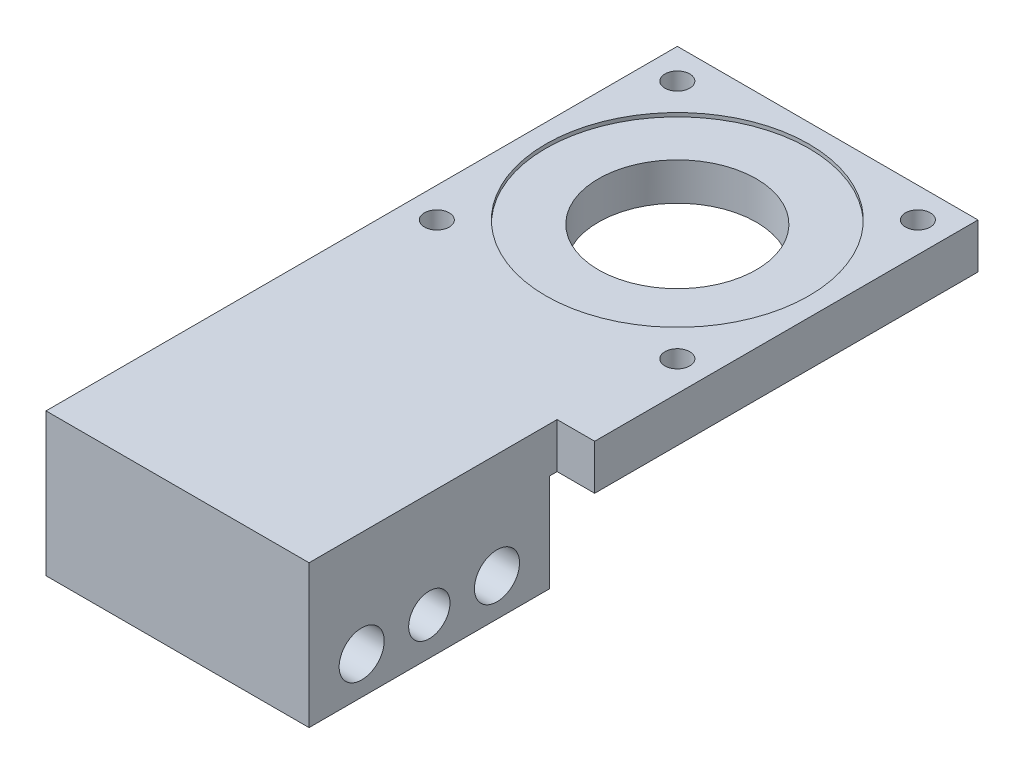
ISO-10303-21;
HEADER;
FILE_DESCRIPTION(('STEP AP214'),'2;1');
FILE_NAME('part.step','',(''),(''),'','','');
FILE_SCHEMA(('AUTOMOTIVE_DESIGN { 1 0 10303 214 1 1 1 1 }'));
ENDSEC;
DATA;
#1=APPLICATION_CONTEXT('core data for automotive mechanical design processes');
#2=APPLICATION_PROTOCOL_DEFINITION('international standard','automotive_design',2000,#1);
#3=PRODUCT_CONTEXT('',#1,'mechanical');
#4=PRODUCT('Part','Part','',(#3));
#5=PRODUCT_RELATED_PRODUCT_CATEGORY('part','',(#4));
#6=PRODUCT_DEFINITION_FORMATION('','',#4);
#7=PRODUCT_DEFINITION_CONTEXT('part definition',#1,'design');
#8=PRODUCT_DEFINITION('design','',#6,#7);
#9=PRODUCT_DEFINITION_SHAPE('','',#8);
#10=(LENGTH_UNIT() NAMED_UNIT(*) SI_UNIT(.MILLI.,.METRE.));
#11=(NAMED_UNIT(*) PLANE_ANGLE_UNIT() SI_UNIT($,.RADIAN.));
#12=(NAMED_UNIT(*) SI_UNIT($,.STERADIAN.) SOLID_ANGLE_UNIT());
#13=UNCERTAINTY_MEASURE_WITH_UNIT(LENGTH_MEASURE(1.E-05),#10,'distance_accuracy_value','');
#14=(GEOMETRIC_REPRESENTATION_CONTEXT(3) GLOBAL_UNCERTAINTY_ASSIGNED_CONTEXT((#13)) GLOBAL_UNIT_ASSIGNED_CONTEXT((#10,
#11,#12)) REPRESENTATION_CONTEXT('',''));
#15=CARTESIAN_POINT('',(0.,0.,0.));
#16=DIRECTION('',(0.,0.,1.));
#17=DIRECTION('',(1.,0.,0.));
#18=AXIS2_PLACEMENT_3D('',#15,#16,#17);
#19=CARTESIAN_POINT('',(0.,6.,0.));
#20=DIRECTION('',(0.,-1.,0.));
#21=DIRECTION('',(0.,0.,-1.));
#22=AXIS2_PLACEMENT_3D('',#19,#20,#21);
#23=CYLINDRICAL_SURFACE('',#22,10.5);
#24=CARTESIAN_POINT('',(0.,5.5,0.));
#25=DIRECTION('',(0.,1.,0.));
#26=DIRECTION('',(0.,0.,1.));
#27=AXIS2_PLACEMENT_3D('',#24,#25,#26);
#28=CIRCLE('',#27,10.5);
#29=CARTESIAN_POINT('',(0.,5.5,10.5));
#30=VERTEX_POINT('',#29);
#31=EDGE_CURVE('E763',#30,#30,#28,.T.);
#32=ORIENTED_EDGE('',*,*,#31,.T.);
#33=EDGE_LOOP('',(#32));
#34=FACE_BOUND('',#33,.T.);
#35=CARTESIAN_POINT('',(0.,0.5,0.));
#36=DIRECTION('',(0.,-1.,0.));
#37=DIRECTION('',(0.,0.,-1.));
#38=AXIS2_PLACEMENT_3D('',#35,#36,#37);
#39=CIRCLE('',#38,10.5);
#40=CARTESIAN_POINT('',(0.,0.5,-10.5));
#41=VERTEX_POINT('',#40);
#42=EDGE_CURVE('E755',#41,#41,#39,.T.);
#43=ORIENTED_EDGE('',*,*,#42,.T.);
#44=EDGE_LOOP('',(#43));
#45=FACE_BOUND('',#44,.T.);
#46=ADVANCED_FACE('F633',(#34,#45),#23,.F.);
#47=CARTESIAN_POINT('',(0.,0.,0.));
#48=DIRECTION('',(0.,1.,0.));
#49=DIRECTION('',(0.,0.,1.));
#50=AXIS2_PLACEMENT_3D('',#47,#48,#49);
#51=PLANE('',#50);
#52=CARTESIAN_POINT('',(0.,0.,0.));
#53=DIRECTION('',(0.,-1.,0.));
#54=DIRECTION('',(0.,0.,-1.));
#55=AXIS2_PLACEMENT_3D('',#52,#53,#54);
#56=CIRCLE('',#55,17.5);
#57=CARTESIAN_POINT('',(0.,0.,-17.5));
#58=VERTEX_POINT('',#57);
#59=EDGE_CURVE('E750',#58,#58,#56,.T.);
#60=ORIENTED_EDGE('',*,*,#59,.F.);
#61=EDGE_LOOP('',(#60));
#62=FACE_BOUND('',#61,.T.);
#63=CARTESIAN_POINT('',(-16.,0.,-16.));
#64=DIRECTION('',(0.,-1.,0.));
#65=DIRECTION('',(0.,0.,-1.));
#66=AXIS2_PLACEMENT_3D('',#63,#64,#65);
#67=CIRCLE('',#66,1.65);
#68=CARTESIAN_POINT('',(-16.,0.,-17.65));
#69=VERTEX_POINT('',#68);
#70=EDGE_CURVE('E768',#69,#69,#67,.T.);
#71=ORIENTED_EDGE('',*,*,#70,.F.);
#72=EDGE_LOOP('',(#71));
#73=FACE_BOUND('',#72,.T.);
#74=CARTESIAN_POINT('',(16.,0.,-16.));
#75=DIRECTION('',(0.,-1.,0.));
#76=DIRECTION('',(0.,0.,-1.));
#77=AXIS2_PLACEMENT_3D('',#74,#75,#76);
#78=CIRCLE('',#77,1.65);
#79=CARTESIAN_POINT('',(16.,0.,-17.65));
#80=VERTEX_POINT('',#79);
#81=EDGE_CURVE('E776',#80,#80,#78,.T.);
#82=ORIENTED_EDGE('',*,*,#81,.F.);
#83=EDGE_LOOP('',(#82));
#84=FACE_BOUND('',#83,.T.);
#85=CARTESIAN_POINT('',(16.,0.,16.));
#86=DIRECTION('',(0.,-1.,0.));
#87=DIRECTION('',(0.,0.,-1.));
#88=AXIS2_PLACEMENT_3D('',#85,#86,#87);
#89=CIRCLE('',#88,1.65);
#90=CARTESIAN_POINT('',(16.,0.,14.35));
#91=VERTEX_POINT('',#90);
#92=EDGE_CURVE('E784',#91,#91,#89,.T.);
#93=ORIENTED_EDGE('',*,*,#92,.F.);
#94=EDGE_LOOP('',(#93));
#95=FACE_BOUND('',#94,.T.);
#96=CARTESIAN_POINT('',(-16.,0.,16.));
#97=DIRECTION('',(0.,-1.,0.));
#98=DIRECTION('',(0.,0.,-1.));
#99=AXIS2_PLACEMENT_3D('',#96,#97,#98);
#100=CIRCLE('',#99,1.65);
#101=CARTESIAN_POINT('',(-16.,0.,14.35));
#102=VERTEX_POINT('',#101);
#103=EDGE_CURVE('E792',#102,#102,#100,.T.);
#104=ORIENTED_EDGE('',*,*,#103,.F.);
#105=EDGE_LOOP('',(#104));
#106=FACE_BOUND('',#105,.T.);
#107=DIRECTION('',(0.,0.,-1.));
#108=VECTOR('',#107,1.);
#109=CARTESIAN_POINT('',(20.,0.,64.));
#110=LINE('',#109,#108);
#111=CARTESIAN_POINT('',(20.,0.,31.));
#112=VERTEX_POINT('',#111);
#113=CARTESIAN_POINT('',(20.,0.,-20.));
#114=VERTEX_POINT('',#113);
#115=EDGE_CURVE('E835',#112,#114,#110,.T.);
#116=ORIENTED_EDGE('',*,*,#115,.F.);
#117=DIRECTION('',(-1.,0.,0.));
#118=VECTOR('',#117,1.);
#119=CARTESIAN_POINT('',(0.,0.,31.));
#120=LINE('',#119,#118);
#121=CARTESIAN_POINT('',(15.,0.,31.));
#122=VERTEX_POINT('',#121);
#123=EDGE_CURVE('E747',#112,#122,#120,.T.);
#124=ORIENTED_EDGE('',*,*,#123,.T.);
#125=DIRECTION('',(0.,0.,1.));
#126=VECTOR('',#125,1.);
#127=CARTESIAN_POINT('',(15.,0.,0.));
#128=LINE('',#127,#126);
#129=CARTESIAN_POINT('',(15.,0.,32.));
#130=VERTEX_POINT('',#129);
#131=EDGE_CURVE('E705',#122,#130,#128,.T.);
#132=ORIENTED_EDGE('',*,*,#131,.T.);
#133=DIRECTION('',(1.,0.,0.));
#134=VECTOR('',#133,1.);
#135=CARTESIAN_POINT('',(-20.,0.,32.));
#136=LINE('',#135,#134);
#137=CARTESIAN_POINT('',(-20.,0.,32.));
#138=VERTEX_POINT('',#137);
#139=EDGE_CURVE('E659',#138,#130,#136,.T.);
#140=ORIENTED_EDGE('',*,*,#139,.F.);
#141=DIRECTION('',(0.,0.,1.));
#142=VECTOR('',#141,1.);
#143=CARTESIAN_POINT('',(-20.,0.,-20.));
#144=LINE('',#143,#142);
#145=CARTESIAN_POINT('',(-20.,0.,-20.));
#146=VERTEX_POINT('',#145);
#147=EDGE_CURVE('E847',#146,#138,#144,.T.);
#148=ORIENTED_EDGE('',*,*,#147,.F.);
#149=DIRECTION('',(-1.,0.,0.));
#150=VECTOR('',#149,1.);
#151=CARTESIAN_POINT('',(20.,0.,-20.));
#152=LINE('',#151,#150);
#153=EDGE_CURVE('E829',#114,#146,#152,.T.);
#154=ORIENTED_EDGE('',*,*,#153,.F.);
#155=EDGE_LOOP('',(#116,#124,#132,#140,#148,#154));
#156=FACE_BOUND('',#155,.T.);
#157=ADVANCED_FACE('F879',(#62,#73,#84,#95,#106,#156),#51,.F.);
#158=CARTESIAN_POINT('',(0.,6.,0.));
#159=DIRECTION('',(0.,1.,0.));
#160=DIRECTION('',(0.,0.,1.));
#161=AXIS2_PLACEMENT_3D('',#158,#159,#160);
#162=PLANE('',#161);
#163=DIRECTION('',(1.,0.,0.));
#164=VECTOR('',#163,1.);
#165=CARTESIAN_POINT('',(15.,6.,31.));
#166=LINE('',#165,#164);
#167=CARTESIAN_POINT('',(15.,6.,31.));
#168=VERTEX_POINT('',#167);
#169=CARTESIAN_POINT('',(20.,6.,31.));
#170=VERTEX_POINT('',#169);
#171=EDGE_CURVE('E712',#168,#170,#166,.T.);
#172=ORIENTED_EDGE('',*,*,#171,.T.);
#173=DIRECTION('',(0.,0.,-1.));
#174=VECTOR('',#173,1.);
#175=CARTESIAN_POINT('',(20.,6.,64.));
#176=LINE('',#175,#174);
#177=CARTESIAN_POINT('',(20.,6.,-20.));
#178=VERTEX_POINT('',#177);
#179=EDGE_CURVE('E840',#170,#178,#176,.T.);
#180=ORIENTED_EDGE('',*,*,#179,.T.);
#181=DIRECTION('',(-1.,0.,0.));
#182=VECTOR('',#181,1.);
#183=CARTESIAN_POINT('',(20.,6.,-20.));
#184=LINE('',#183,#182);
#185=CARTESIAN_POINT('',(-20.,6.,-20.));
#186=VERTEX_POINT('',#185);
#187=EDGE_CURVE('E830',#178,#186,#184,.T.);
#188=ORIENTED_EDGE('',*,*,#187,.T.);
#189=DIRECTION('',(0.,0.,1.));
#190=VECTOR('',#189,1.);
#191=CARTESIAN_POINT('',(-20.,6.,-20.));
#192=LINE('',#191,#190);
#193=CARTESIAN_POINT('',(-20.,6.,64.));
#194=VERTEX_POINT('',#193);
#195=EDGE_CURVE('E834',#186,#194,#192,.T.);
#196=ORIENTED_EDGE('',*,*,#195,.T.);
#197=DIRECTION('',(1.,0.,0.));
#198=VECTOR('',#197,1.);
#199=CARTESIAN_POINT('',(-20.,6.,64.));
#200=LINE('',#199,#198);
#201=CARTESIAN_POINT('',(15.,6.,64.));
#202=VERTEX_POINT('',#201);
#203=EDGE_CURVE('E724',#194,#202,#200,.T.);
#204=ORIENTED_EDGE('',*,*,#203,.T.);
#205=DIRECTION('',(0.,0.,1.));
#206=VECTOR('',#205,1.);
#207=CARTESIAN_POINT('',(15.,6.,64.));
#208=LINE('',#207,#206);
#209=EDGE_CURVE('E704',#168,#202,#208,.T.);
#210=ORIENTED_EDGE('',*,*,#209,.F.);
#211=EDGE_LOOP('',(#172,#180,#188,#196,#204,#210));
#212=FACE_BOUND('',#211,.T.);
#213=CARTESIAN_POINT('',(0.,6.,0.));
#214=DIRECTION('',(0.,1.,0.));
#215=DIRECTION('',(0.,0.,1.));
#216=AXIS2_PLACEMENT_3D('',#213,#214,#215);
#217=CIRCLE('',#216,17.5);
#218=CARTESIAN_POINT('',(0.,6.,17.5));
#219=VERTEX_POINT('',#218);
#220=EDGE_CURVE('E764',#219,#219,#217,.T.);
#221=ORIENTED_EDGE('',*,*,#220,.F.);
#222=EDGE_LOOP('',(#221));
#223=FACE_BOUND('',#222,.T.);
#224=CARTESIAN_POINT('',(-16.,6.,-16.));
#225=DIRECTION('',(0.,-1.,0.));
#226=DIRECTION('',(0.,0.,-1.));
#227=AXIS2_PLACEMENT_3D('',#224,#225,#226);
#228=CIRCLE('',#227,1.65);
#229=CARTESIAN_POINT('',(-16.,6.,-17.65));
#230=VERTEX_POINT('',#229);
#231=EDGE_CURVE('E772',#230,#230,#228,.T.);
#232=ORIENTED_EDGE('',*,*,#231,.T.);
#233=EDGE_LOOP('',(#232));
#234=FACE_BOUND('',#233,.T.);
#235=CARTESIAN_POINT('',(16.,6.,-16.));
#236=DIRECTION('',(0.,-1.,0.));
#237=DIRECTION('',(0.,0.,-1.));
#238=AXIS2_PLACEMENT_3D('',#235,#236,#237);
#239=CIRCLE('',#238,1.65);
#240=CARTESIAN_POINT('',(16.,6.,-17.65));
#241=VERTEX_POINT('',#240);
#242=EDGE_CURVE('E780',#241,#241,#239,.T.);
#243=ORIENTED_EDGE('',*,*,#242,.T.);
#244=EDGE_LOOP('',(#243));
#245=FACE_BOUND('',#244,.T.);
#246=CARTESIAN_POINT('',(16.,6.,16.));
#247=DIRECTION('',(0.,-1.,0.));
#248=DIRECTION('',(0.,0.,-1.));
#249=AXIS2_PLACEMENT_3D('',#246,#247,#248);
#250=CIRCLE('',#249,1.65);
#251=CARTESIAN_POINT('',(16.,6.,14.35));
#252=VERTEX_POINT('',#251);
#253=EDGE_CURVE('E788',#252,#252,#250,.T.);
#254=ORIENTED_EDGE('',*,*,#253,.T.);
#255=EDGE_LOOP('',(#254));
#256=FACE_BOUND('',#255,.T.);
#257=CARTESIAN_POINT('',(-16.,6.,16.));
#258=DIRECTION('',(0.,-1.,0.));
#259=DIRECTION('',(0.,0.,-1.));
#260=AXIS2_PLACEMENT_3D('',#257,#258,#259);
#261=CIRCLE('',#260,1.65);
#262=CARTESIAN_POINT('',(-16.,6.,14.35));
#263=VERTEX_POINT('',#262);
#264=EDGE_CURVE('E796',#263,#263,#261,.T.);
#265=ORIENTED_EDGE('',*,*,#264,.T.);
#266=EDGE_LOOP('',(#265));
#267=FACE_BOUND('',#266,.T.);
#268=ADVANCED_FACE('F721',(#212,#223,#234,#245,#256,#267),#162,.T.);
#269=CARTESIAN_POINT('',(20.,6.,-20.));
#270=DIRECTION('',(0.,0.,1.));
#271=DIRECTION('',(1.,0.,0.));
#272=AXIS2_PLACEMENT_3D('',#269,#270,#271);
#273=PLANE('',#272);
#274=ORIENTED_EDGE('',*,*,#153,.T.);
#275=DIRECTION('',(0.,-1.,0.));
#276=VECTOR('',#275,1.);
#277=CARTESIAN_POINT('',(-20.,6.,-20.));
#278=LINE('',#277,#276);
#279=EDGE_CURVE('E14',#186,#146,#278,.T.);
#280=ORIENTED_EDGE('',*,*,#279,.F.);
#281=ORIENTED_EDGE('',*,*,#187,.F.);
#282=DIRECTION('',(0.,-1.,0.));
#283=VECTOR('',#282,1.);
#284=CARTESIAN_POINT('',(20.,6.,-20.));
#285=LINE('',#284,#283);
#286=EDGE_CURVE('E843',#178,#114,#285,.T.);
#287=ORIENTED_EDGE('',*,*,#286,.T.);
#288=EDGE_LOOP('',(#274,#280,#281,#287));
#289=FACE_BOUND('',#288,.T.);
#290=ADVANCED_FACE('F635',(#289),#273,.F.);
#291=CARTESIAN_POINT('',(-20.,6.,-20.));
#292=DIRECTION('',(1.,0.,0.));
#293=DIRECTION('',(0.,0.,-1.));
#294=AXIS2_PLACEMENT_3D('',#291,#292,#293);
#295=PLANE('',#294);
#296=CARTESIAN_POINT('',(-20.,-8.,48.));
#297=DIRECTION('',(-1.,0.,0.));
#298=DIRECTION('',(0.,0.,1.));
#299=AXIS2_PLACEMENT_3D('',#296,#297,#298);
#300=CIRCLE('',#299,2.75);
#301=CARTESIAN_POINT('',(-20.,-8.,50.75));
#302=VERTEX_POINT('',#301);
#303=EDGE_CURVE('E800',#302,#302,#300,.T.);
#304=ORIENTED_EDGE('',*,*,#303,.F.);
#305=EDGE_LOOP('',(#304));
#306=FACE_BOUND('',#305,.T.);
#307=CARTESIAN_POINT('',(-20.,-8.,57.));
#308=DIRECTION('',(1.,0.,0.));
#309=DIRECTION('',(0.,0.,-1.));
#310=AXIS2_PLACEMENT_3D('',#307,#308,#309);
#311=CIRCLE('',#310,2.99999999999999);
#312=CARTESIAN_POINT('',(-20.,-8.,54.));
#313=VERTEX_POINT('',#312);
#314=EDGE_CURVE('E804',#313,#313,#311,.T.);
#315=ORIENTED_EDGE('',*,*,#314,.T.);
#316=EDGE_LOOP('',(#315));
#317=FACE_BOUND('',#316,.T.);
#318=CARTESIAN_POINT('',(-20.,-8.,39.));
#319=DIRECTION('',(1.,0.,0.));
#320=DIRECTION('',(0.,0.,-1.));
#321=AXIS2_PLACEMENT_3D('',#318,#319,#320);
#322=CIRCLE('',#321,2.99999999999999);
#323=CARTESIAN_POINT('',(-20.,-8.,36.));
#324=VERTEX_POINT('',#323);
#325=EDGE_CURVE('E808',#324,#324,#322,.T.);
#326=ORIENTED_EDGE('',*,*,#325,.T.);
#327=EDGE_LOOP('',(#326));
#328=FACE_BOUND('',#327,.T.);
#329=ORIENTED_EDGE('',*,*,#147,.T.);
#330=DIRECTION('',(0.,1.,0.));
#331=VECTOR('',#330,1.);
#332=CARTESIAN_POINT('',(-20.,-13.,32.));
#333=LINE('',#332,#331);
#334=CARTESIAN_POINT('',(-20.,-13.,32.));
#335=VERTEX_POINT('',#334);
#336=EDGE_CURVE('E823',#335,#138,#333,.T.);
#337=ORIENTED_EDGE('',*,*,#336,.F.);
#338=DIRECTION('',(0.,0.,-1.));
#339=VECTOR('',#338,1.);
#340=CARTESIAN_POINT('',(-20.,-13.,64.));
#341=LINE('',#340,#339);
#342=CARTESIAN_POINT('',(-20.,-13.,64.));
#343=VERTEX_POINT('',#342);
#344=EDGE_CURVE('E812',#343,#335,#341,.T.);
#345=ORIENTED_EDGE('',*,*,#344,.F.);
#346=DIRECTION('',(0.,-1.,0.));
#347=VECTOR('',#346,1.);
#348=CARTESIAN_POINT('',(-20.,6.,64.));
#349=LINE('',#348,#347);
#350=EDGE_CURVE('E643',#194,#343,#349,.T.);
#351=ORIENTED_EDGE('',*,*,#350,.F.);
#352=ORIENTED_EDGE('',*,*,#195,.F.);
#353=ORIENTED_EDGE('',*,*,#279,.T.);
#354=EDGE_LOOP('',(#329,#337,#345,#351,#352,#353));
#355=FACE_BOUND('',#354,.T.);
#356=ADVANCED_FACE('F901',(#306,#317,#328,#355),#295,.F.);
#357=CARTESIAN_POINT('',(-20.,6.,64.));
#358=DIRECTION('',(0.,0.,-1.));
#359=DIRECTION('',(-1.,0.,0.));
#360=AXIS2_PLACEMENT_3D('',#357,#358,#359);
#361=PLANE('',#360);
#362=DIRECTION('',(-1.,0.,0.));
#363=VECTOR('',#362,1.);
#364=CARTESIAN_POINT('',(-20.,-13.,64.));
#365=LINE('',#364,#363);
#366=CARTESIAN_POINT('',(15.,-13.,64.));
#367=VERTEX_POINT('',#366);
#368=EDGE_CURVE('E820',#367,#343,#365,.T.);
#369=ORIENTED_EDGE('',*,*,#368,.F.);
#370=DIRECTION('',(0.,-1.,0.));
#371=VECTOR('',#370,1.);
#372=CARTESIAN_POINT('',(15.,-13.,64.));
#373=LINE('',#372,#371);
#374=EDGE_CURVE('E651',#202,#367,#373,.T.);
#375=ORIENTED_EDGE('',*,*,#374,.F.);
#376=ORIENTED_EDGE('',*,*,#203,.F.);
#377=ORIENTED_EDGE('',*,*,#350,.T.);
#378=EDGE_LOOP('',(#369,#375,#376,#377));
#379=FACE_BOUND('',#378,.T.);
#380=ADVANCED_FACE('F905',(#379),#361,.F.);
#381=CARTESIAN_POINT('',(20.,6.,64.));
#382=DIRECTION('',(-1.,0.,0.));
#383=DIRECTION('',(0.,0.,1.));
#384=AXIS2_PLACEMENT_3D('',#381,#382,#383);
#385=PLANE('',#384);
#386=ORIENTED_EDGE('',*,*,#179,.F.);
#387=DIRECTION('',(0.,1.,0.));
#388=VECTOR('',#387,1.);
#389=CARTESIAN_POINT('',(20.,-13.,31.));
#390=LINE('',#389,#388);
#391=EDGE_CURVE('E715',#112,#170,#390,.T.);
#392=ORIENTED_EDGE('',*,*,#391,.F.);
#393=ORIENTED_EDGE('',*,*,#115,.T.);
#394=ORIENTED_EDGE('',*,*,#286,.F.);
#395=EDGE_LOOP('',(#386,#392,#393,#394));
#396=FACE_BOUND('',#395,.T.);
#397=ADVANCED_FACE('F894',(#396),#385,.F.);
#398=CARTESIAN_POINT('',(-20.,-13.,32.));
#399=DIRECTION('',(0.,0.,1.));
#400=DIRECTION('',(1.,0.,0.));
#401=AXIS2_PLACEMENT_3D('',#398,#399,#400);
#402=PLANE('',#401);
#403=ORIENTED_EDGE('',*,*,#139,.T.);
#404=DIRECTION('',(0.,-1.,0.));
#405=VECTOR('',#404,1.);
#406=CARTESIAN_POINT('',(15.,-13.,32.));
#407=LINE('',#406,#405);
#408=CARTESIAN_POINT('',(15.,-13.,32.));
#409=VERTEX_POINT('',#408);
#410=EDGE_CURVE('E741',#130,#409,#407,.T.);
#411=ORIENTED_EDGE('',*,*,#410,.T.);
#412=DIRECTION('',(1.,0.,0.));
#413=VECTOR('',#412,1.);
#414=CARTESIAN_POINT('',(-20.,-13.,32.));
#415=LINE('',#414,#413);
#416=EDGE_CURVE('E816',#335,#409,#415,.T.);
#417=ORIENTED_EDGE('',*,*,#416,.F.);
#418=ORIENTED_EDGE('',*,*,#336,.T.);
#419=EDGE_LOOP('',(#403,#411,#417,#418));
#420=FACE_BOUND('',#419,.T.);
#421=ADVANCED_FACE('F915',(#420),#402,.F.);
#422=CARTESIAN_POINT('',(0.,-13.,0.));
#423=DIRECTION('',(0.,-1.,0.));
#424=DIRECTION('',(0.,0.,-1.));
#425=AXIS2_PLACEMENT_3D('',#422,#423,#424);
#426=PLANE('',#425);
#427=DIRECTION('',(0.,0.,-1.));
#428=VECTOR('',#427,1.);
#429=CARTESIAN_POINT('',(15.,-13.,64.));
#430=LINE('',#429,#428);
#431=EDGE_CURVE('E709',#367,#409,#430,.T.);
#432=ORIENTED_EDGE('',*,*,#431,.F.);
#433=ORIENTED_EDGE('',*,*,#368,.T.);
#434=ORIENTED_EDGE('',*,*,#344,.T.);
#435=ORIENTED_EDGE('',*,*,#416,.T.);
#436=EDGE_LOOP('',(#432,#433,#434,#435));
#437=FACE_BOUND('',#436,.T.);
#438=ADVANCED_FACE('F916',(#437),#426,.T.);
#439=CARTESIAN_POINT('',(20.,-8.,39.));
#440=DIRECTION('',(1.,0.,0.));
#441=DIRECTION('',(0.,0.,-1.));
#442=AXIS2_PLACEMENT_3D('',#439,#440,#441);
#443=CYLINDRICAL_SURFACE('',#442,2.99999999999999);
#444=CARTESIAN_POINT('',(15.,-8.,39.));
#445=DIRECTION('',(-1.,0.,0.));
#446=DIRECTION('',(0.,0.,1.));
#447=AXIS2_PLACEMENT_3D('',#444,#445,#446);
#448=CIRCLE('',#447,2.99999999999999);
#449=CARTESIAN_POINT('',(15.,-8.,42.));
#450=VERTEX_POINT('',#449);
#451=EDGE_CURVE('E737',#450,#450,#448,.F.);
#452=ORIENTED_EDGE('',*,*,#451,.T.);
#453=EDGE_LOOP('',(#452));
#454=FACE_BOUND('',#453,.T.);
#455=ORIENTED_EDGE('',*,*,#325,.F.);
#456=EDGE_LOOP('',(#455));
#457=FACE_BOUND('',#456,.T.);
#458=ADVANCED_FACE('F918',(#454,#457),#443,.F.);
#459=CARTESIAN_POINT('',(20.,-8.,57.));
#460=DIRECTION('',(1.,0.,0.));
#461=DIRECTION('',(0.,0.,-1.));
#462=AXIS2_PLACEMENT_3D('',#459,#460,#461);
#463=CYLINDRICAL_SURFACE('',#462,2.99999999999999);
#464=CARTESIAN_POINT('',(15.,-8.,57.));
#465=DIRECTION('',(-1.,0.,0.));
#466=DIRECTION('',(0.,0.,1.));
#467=AXIS2_PLACEMENT_3D('',#464,#465,#466);
#468=CIRCLE('',#467,2.99999999999999);
#469=CARTESIAN_POINT('',(15.,-8.,60.));
#470=VERTEX_POINT('',#469);
#471=EDGE_CURVE('E733',#470,#470,#468,.F.);
#472=ORIENTED_EDGE('',*,*,#471,.T.);
#473=EDGE_LOOP('',(#472));
#474=FACE_BOUND('',#473,.T.);
#475=ORIENTED_EDGE('',*,*,#314,.F.);
#476=EDGE_LOOP('',(#475));
#477=FACE_BOUND('',#476,.T.);
#478=ADVANCED_FACE('F924',(#474,#477),#463,.F.);
#479=CARTESIAN_POINT('',(-20.,-8.,48.));
#480=DIRECTION('',(-1.,0.,0.));
#481=DIRECTION('',(0.,0.,1.));
#482=AXIS2_PLACEMENT_3D('',#479,#480,#481);
#483=CYLINDRICAL_SURFACE('',#482,2.74999999999999);
#484=CARTESIAN_POINT('',(15.,-8.,48.));
#485=DIRECTION('',(-1.,0.,0.));
#486=DIRECTION('',(0.,0.,1.));
#487=AXIS2_PLACEMENT_3D('',#484,#485,#486);
#488=CIRCLE('',#487,2.74999999999999);
#489=CARTESIAN_POINT('',(15.,-8.,50.75));
#490=VERTEX_POINT('',#489);
#491=EDGE_CURVE('E637',#490,#490,#488,.F.);
#492=ORIENTED_EDGE('',*,*,#491,.T.);
#493=EDGE_LOOP('',(#492));
#494=FACE_BOUND('',#493,.T.);
#495=ORIENTED_EDGE('',*,*,#303,.T.);
#496=EDGE_LOOP('',(#495));
#497=FACE_BOUND('',#496,.T.);
#498=ADVANCED_FACE('F954',(#494,#497),#483,.F.);
#499=CARTESIAN_POINT('',(-16.,0.,16.));
#500=DIRECTION('',(0.,-1.,0.));
#501=DIRECTION('',(0.,0.,-1.));
#502=AXIS2_PLACEMENT_3D('',#499,#500,#501);
#503=CYLINDRICAL_SURFACE('',#502,1.65);
#504=ORIENTED_EDGE('',*,*,#264,.F.);
#505=EDGE_LOOP('',(#504));
#506=FACE_BOUND('',#505,.T.);
#507=ORIENTED_EDGE('',*,*,#103,.T.);
#508=EDGE_LOOP('',(#507));
#509=FACE_BOUND('',#508,.T.);
#510=ADVANCED_FACE('F961',(#506,#509),#503,.F.);
#511=CARTESIAN_POINT('',(16.,0.,16.));
#512=DIRECTION('',(0.,-1.,0.));
#513=DIRECTION('',(0.,0.,-1.));
#514=AXIS2_PLACEMENT_3D('',#511,#512,#513);
#515=CYLINDRICAL_SURFACE('',#514,1.65);
#516=ORIENTED_EDGE('',*,*,#253,.F.);
#517=EDGE_LOOP('',(#516));
#518=FACE_BOUND('',#517,.T.);
#519=ORIENTED_EDGE('',*,*,#92,.T.);
#520=EDGE_LOOP('',(#519));
#521=FACE_BOUND('',#520,.T.);
#522=ADVANCED_FACE('F966',(#518,#521),#515,.F.);
#523=CARTESIAN_POINT('',(16.,0.,-16.));
#524=DIRECTION('',(0.,-1.,0.));
#525=DIRECTION('',(0.,0.,-1.));
#526=AXIS2_PLACEMENT_3D('',#523,#524,#525);
#527=CYLINDRICAL_SURFACE('',#526,1.65);
#528=ORIENTED_EDGE('',*,*,#242,.F.);
#529=EDGE_LOOP('',(#528));
#530=FACE_BOUND('',#529,.T.);
#531=ORIENTED_EDGE('',*,*,#81,.T.);
#532=EDGE_LOOP('',(#531));
#533=FACE_BOUND('',#532,.T.);
#534=ADVANCED_FACE('F970',(#530,#533),#527,.F.);
#535=CARTESIAN_POINT('',(-16.,0.,-16.));
#536=DIRECTION('',(0.,-1.,0.));
#537=DIRECTION('',(0.,0.,-1.));
#538=AXIS2_PLACEMENT_3D('',#535,#536,#537);
#539=CYLINDRICAL_SURFACE('',#538,1.65);
#540=ORIENTED_EDGE('',*,*,#231,.F.);
#541=EDGE_LOOP('',(#540));
#542=FACE_BOUND('',#541,.T.);
#543=ORIENTED_EDGE('',*,*,#70,.T.);
#544=EDGE_LOOP('',(#543));
#545=FACE_BOUND('',#544,.T.);
#546=ADVANCED_FACE('F974',(#542,#545),#539,.F.);
#547=CARTESIAN_POINT('',(0.,5.5,0.));
#548=DIRECTION('',(0.,1.,0.));
#549=DIRECTION('',(0.,0.,1.));
#550=AXIS2_PLACEMENT_3D('',#547,#548,#549);
#551=CYLINDRICAL_SURFACE('',#550,17.5);
#552=CARTESIAN_POINT('',(0.,5.5,0.));
#553=DIRECTION('',(0.,1.,0.));
#554=DIRECTION('',(0.,0.,1.));
#555=AXIS2_PLACEMENT_3D('',#552,#553,#554);
#556=CIRCLE('',#555,17.5);
#557=CARTESIAN_POINT('',(0.,5.5,17.5));
#558=VERTEX_POINT('',#557);
#559=EDGE_CURVE('E759',#558,#558,#556,.T.);
#560=ORIENTED_EDGE('',*,*,#559,.F.);
#561=EDGE_LOOP('',(#560));
#562=FACE_BOUND('',#561,.T.);
#563=ORIENTED_EDGE('',*,*,#220,.T.);
#564=EDGE_LOOP('',(#563));
#565=FACE_BOUND('',#564,.T.);
#566=ADVANCED_FACE('F978',(#562,#565),#551,.F.);
#567=CARTESIAN_POINT('',(0.,5.5,0.));
#568=DIRECTION('',(0.,1.,0.));
#569=DIRECTION('',(0.,0.,1.));
#570=AXIS2_PLACEMENT_3D('',#567,#568,#569);
#571=PLANE('',#570);
#572=ORIENTED_EDGE('',*,*,#31,.F.);
#573=EDGE_LOOP('',(#572));
#574=FACE_BOUND('',#573,.T.);
#575=ORIENTED_EDGE('',*,*,#559,.T.);
#576=EDGE_LOOP('',(#575));
#577=FACE_BOUND('',#576,.T.);
#578=ADVANCED_FACE('F875',(#574,#577),#571,.T.);
#579=CARTESIAN_POINT('',(0.,0.5,0.));
#580=DIRECTION('',(0.,-1.,0.));
#581=DIRECTION('',(0.,0.,-1.));
#582=AXIS2_PLACEMENT_3D('',#579,#580,#581);
#583=CYLINDRICAL_SURFACE('',#582,17.5);
#584=CARTESIAN_POINT('',(0.,0.5,0.));
#585=DIRECTION('',(0.,-1.,0.));
#586=DIRECTION('',(0.,0.,-1.));
#587=AXIS2_PLACEMENT_3D('',#584,#585,#586);
#588=CIRCLE('',#587,17.5);
#589=CARTESIAN_POINT('',(0.,0.5,-17.5));
#590=VERTEX_POINT('',#589);
#591=EDGE_CURVE('E751',#590,#590,#588,.T.);
#592=ORIENTED_EDGE('',*,*,#591,.F.);
#593=EDGE_LOOP('',(#592));
#594=FACE_BOUND('',#593,.T.);
#595=ORIENTED_EDGE('',*,*,#59,.T.);
#596=EDGE_LOOP('',(#595));
#597=FACE_BOUND('',#596,.T.);
#598=ADVANCED_FACE('F869',(#594,#597),#583,.F.);
#599=CARTESIAN_POINT('',(0.,0.5,0.));
#600=DIRECTION('',(0.,-1.,0.));
#601=DIRECTION('',(0.,0.,-1.));
#602=AXIS2_PLACEMENT_3D('',#599,#600,#601);
#603=PLANE('',#602);
#604=ORIENTED_EDGE('',*,*,#42,.F.);
#605=EDGE_LOOP('',(#604));
#606=FACE_BOUND('',#605,.T.);
#607=ORIENTED_EDGE('',*,*,#591,.T.);
#608=EDGE_LOOP('',(#607));
#609=FACE_BOUND('',#608,.T.);
#610=ADVANCED_FACE('F866',(#606,#609),#603,.T.);
#611=CARTESIAN_POINT('',(15.,-13.,31.));
#612=DIRECTION('',(0.,0.,-1.));
#613=DIRECTION('',(-1.,0.,0.));
#614=AXIS2_PLACEMENT_3D('',#611,#612,#613);
#615=PLANE('',#614);
#616=ORIENTED_EDGE('',*,*,#391,.T.);
#617=ORIENTED_EDGE('',*,*,#171,.F.);
#618=DIRECTION('',(0.,1.,0.));
#619=VECTOR('',#618,1.);
#620=CARTESIAN_POINT('',(15.,-13.,31.));
#621=LINE('',#620,#619);
#622=EDGE_CURVE('E700',#122,#168,#621,.T.);
#623=ORIENTED_EDGE('',*,*,#622,.F.);
#624=ORIENTED_EDGE('',*,*,#123,.F.);
#625=EDGE_LOOP('',(#616,#617,#623,#624));
#626=FACE_BOUND('',#625,.T.);
#627=ADVANCED_FACE('F713',(#626),#615,.F.);
#628=CARTESIAN_POINT('',(15.,0.,0.));
#629=DIRECTION('',(-1.,0.,0.));
#630=DIRECTION('',(0.,0.,1.));
#631=AXIS2_PLACEMENT_3D('',#628,#629,#630);
#632=PLANE('',#631);
#633=ORIENTED_EDGE('',*,*,#471,.F.);
#634=EDGE_LOOP('',(#633));
#635=FACE_BOUND('',#634,.T.);
#636=ORIENTED_EDGE('',*,*,#491,.F.);
#637=EDGE_LOOP('',(#636));
#638=FACE_BOUND('',#637,.T.);
#639=ORIENTED_EDGE('',*,*,#451,.F.);
#640=EDGE_LOOP('',(#639));
#641=FACE_BOUND('',#640,.T.);
#642=ORIENTED_EDGE('',*,*,#622,.T.);
#643=ORIENTED_EDGE('',*,*,#209,.T.);
#644=ORIENTED_EDGE('',*,*,#374,.T.);
#645=ORIENTED_EDGE('',*,*,#431,.T.);
#646=ORIENTED_EDGE('',*,*,#410,.F.);
#647=ORIENTED_EDGE('',*,*,#131,.F.);
#648=EDGE_LOOP('',(#642,#643,#644,#645,#646,#647));
#649=FACE_BOUND('',#648,.T.);
#650=ADVANCED_FACE('F702',(#635,#638,#641,#649),#632,.F.);
#651=CLOSED_SHELL('',(#46,#157,#268,#290,#356,#380,#397,#421,#438,#458,#478,#498,#510,#522,#534,
#546,#566,#578,#598,#610,#627,#650));
#652=MANIFOLD_SOLID_BREP('B2',#651);
#653=ADVANCED_BREP_SHAPE_REPRESENTATION('',(#18,#652),#14);
#654=SHAPE_DEFINITION_REPRESENTATION(#9,#653);
ENDSEC;
END-ISO-10303-21;
